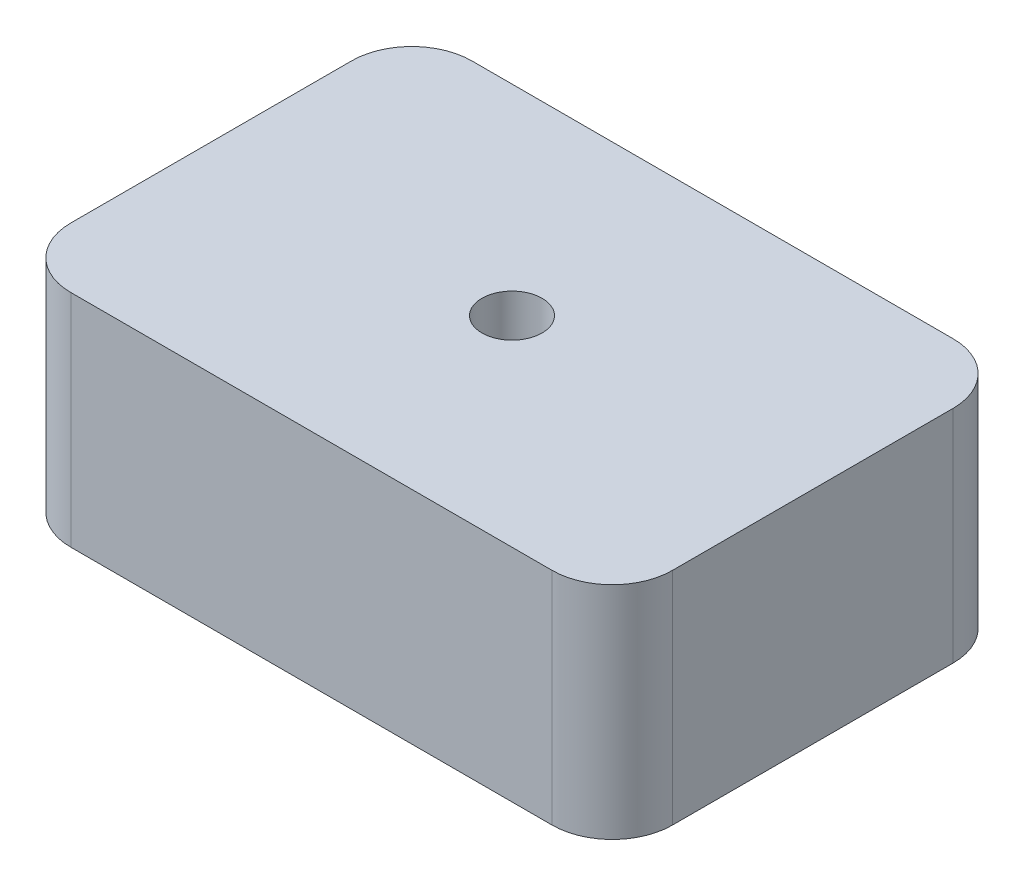
ISO-10303-21;
HEADER;
FILE_DESCRIPTION(('STEP AP214'),'2;1');
FILE_NAME('part.step','',(''),(''),'','','');
FILE_SCHEMA(('AUTOMOTIVE_DESIGN { 1 0 10303 214 1 1 1 1 }'));
ENDSEC;
DATA;
#1=APPLICATION_CONTEXT('core data for automotive mechanical design processes');
#2=APPLICATION_PROTOCOL_DEFINITION('international standard','automotive_design',2000,#1);
#3=PRODUCT_CONTEXT('',#1,'mechanical');
#4=PRODUCT('Part','Part','',(#3));
#5=PRODUCT_RELATED_PRODUCT_CATEGORY('part','',(#4));
#6=PRODUCT_DEFINITION_FORMATION('','',#4);
#7=PRODUCT_DEFINITION_CONTEXT('part definition',#1,'design');
#8=PRODUCT_DEFINITION('design','',#6,#7);
#9=PRODUCT_DEFINITION_SHAPE('','',#8);
#10=(LENGTH_UNIT() NAMED_UNIT(*) SI_UNIT(.MILLI.,.METRE.));
#11=(NAMED_UNIT(*) PLANE_ANGLE_UNIT() SI_UNIT($,.RADIAN.));
#12=(NAMED_UNIT(*) SI_UNIT($,.STERADIAN.) SOLID_ANGLE_UNIT());
#13=UNCERTAINTY_MEASURE_WITH_UNIT(LENGTH_MEASURE(1.E-05),#10,'distance_accuracy_value','');
#14=(GEOMETRIC_REPRESENTATION_CONTEXT(3) GLOBAL_UNCERTAINTY_ASSIGNED_CONTEXT((#13)) GLOBAL_UNIT_ASSIGNED_CONTEXT((#10,
#11,#12)) REPRESENTATION_CONTEXT('',''));
#15=CARTESIAN_POINT('',(0.,0.,0.));
#16=DIRECTION('',(0.,0.,1.));
#17=DIRECTION('',(1.,0.,0.));
#18=AXIS2_PLACEMENT_3D('',#15,#16,#17);
#19=CARTESIAN_POINT('',(0.,55.,0.));
#20=DIRECTION('',(0.,-1.,0.));
#21=DIRECTION('',(0.,0.,-1.));
#22=AXIS2_PLACEMENT_3D('',#19,#20,#21);
#23=PLANE('',#22);
#24=DIRECTION('',(0.,0.,-1.));
#25=VECTOR('',#24,1.);
#26=CARTESIAN_POINT('',(75.,55.,50.));
#27=LINE('',#26,#25);
#28=CARTESIAN_POINT('',(75.,55.,35.));
#29=VERTEX_POINT('',#28);
#30=CARTESIAN_POINT('',(75.,55.,-35.));
#31=VERTEX_POINT('',#30);
#32=EDGE_CURVE('E149',#29,#31,#27,.T.);
#33=ORIENTED_EDGE('',*,*,#32,.T.);
#34=CARTESIAN_POINT('',(60.,55.,-35.));
#35=DIRECTION('',(0.,-1.,0.));
#36=DIRECTION('',(0.,0.,-1.));
#37=AXIS2_PLACEMENT_3D('',#34,#35,#36);
#38=CIRCLE('',#37,15.);
#39=CARTESIAN_POINT('',(60.,55.,-50.));
#40=VERTEX_POINT('',#39);
#41=EDGE_CURVE('E173',#31,#40,#38,.F.);
#42=ORIENTED_EDGE('',*,*,#41,.T.);
#43=DIRECTION('',(-1.,0.,0.));
#44=VECTOR('',#43,1.);
#45=CARTESIAN_POINT('',(-75.,55.,-50.));
#46=LINE('',#45,#44);
#47=CARTESIAN_POINT('',(-60.,55.,-50.));
#48=VERTEX_POINT('',#47);
#49=EDGE_CURVE('E126',#40,#48,#46,.T.);
#50=ORIENTED_EDGE('',*,*,#49,.T.);
#51=CARTESIAN_POINT('',(-60.,55.,-35.));
#52=DIRECTION('',(0.,-1.,0.));
#53=DIRECTION('',(0.,0.,-1.));
#54=AXIS2_PLACEMENT_3D('',#51,#52,#53);
#55=CIRCLE('',#54,15.);
#56=CARTESIAN_POINT('',(-75.,55.,-35.));
#57=VERTEX_POINT('',#56);
#58=EDGE_CURVE('E170',#48,#57,#55,.F.);
#59=ORIENTED_EDGE('',*,*,#58,.T.);
#60=DIRECTION('',(0.,0.,1.));
#61=VECTOR('',#60,1.);
#62=CARTESIAN_POINT('',(-75.,55.,50.));
#63=LINE('',#62,#61);
#64=CARTESIAN_POINT('',(-75.,55.,35.));
#65=VERTEX_POINT('',#64);
#66=EDGE_CURVE('E185',#57,#65,#63,.T.);
#67=ORIENTED_EDGE('',*,*,#66,.T.);
#68=CARTESIAN_POINT('',(-60.,55.,35.));
#69=DIRECTION('',(0.,-1.,0.));
#70=DIRECTION('',(0.,0.,-1.));
#71=AXIS2_PLACEMENT_3D('',#68,#69,#70);
#72=CIRCLE('',#71,15.);
#73=CARTESIAN_POINT('',(-60.,55.,50.));
#74=VERTEX_POINT('',#73);
#75=EDGE_CURVE('E60',#65,#74,#72,.F.);
#76=ORIENTED_EDGE('',*,*,#75,.T.);
#77=DIRECTION('',(1.,0.,0.));
#78=VECTOR('',#77,1.);
#79=CARTESIAN_POINT('',(-75.,55.,50.));
#80=LINE('',#79,#78);
#81=CARTESIAN_POINT('',(60.,55.,50.));
#82=VERTEX_POINT('',#81);
#83=EDGE_CURVE('E151',#74,#82,#80,.T.);
#84=ORIENTED_EDGE('',*,*,#83,.T.);
#85=CARTESIAN_POINT('',(60.,55.,35.));
#86=DIRECTION('',(0.,-1.,0.));
#87=DIRECTION('',(0.,0.,-1.));
#88=AXIS2_PLACEMENT_3D('',#85,#86,#87);
#89=CIRCLE('',#88,15.);
#90=EDGE_CURVE('E165',#82,#29,#89,.F.);
#91=ORIENTED_EDGE('',*,*,#90,.T.);
#92=EDGE_LOOP('',(#33,#42,#50,#59,#67,#76,#84,#91));
#93=FACE_BOUND('',#92,.T.);
#94=CARTESIAN_POINT('',(0.,55.,0.));
#95=DIRECTION('',(0.,1.,0.));
#96=DIRECTION('',(0.,0.,1.));
#97=AXIS2_PLACEMENT_3D('',#94,#95,#96);
#98=CIRCLE('',#97,7.5);
#99=CARTESIAN_POINT('',(0.,55.,7.5));
#100=VERTEX_POINT('',#99);
#101=EDGE_CURVE('E143',#100,#100,#98,.T.);
#102=ORIENTED_EDGE('',*,*,#101,.F.);
#103=EDGE_LOOP('',(#102));
#104=FACE_BOUND('',#103,.T.);
#105=ADVANCED_FACE('F38',(#93,#104),#23,.F.);
#106=CARTESIAN_POINT('',(0.,0.,0.));
#107=DIRECTION('',(0.,-1.,0.));
#108=DIRECTION('',(0.,0.,-1.));
#109=AXIS2_PLACEMENT_3D('',#106,#107,#108);
#110=PLANE('',#109);
#111=DIRECTION('',(-1.,0.,0.));
#112=VECTOR('',#111,1.);
#113=CARTESIAN_POINT('',(-75.,0.,-50.));
#114=LINE('',#113,#112);
#115=CARTESIAN_POINT('',(60.,0.,-50.));
#116=VERTEX_POINT('',#115);
#117=CARTESIAN_POINT('',(-60.,0.,-50.));
#118=VERTEX_POINT('',#117);
#119=EDGE_CURVE('E123',#116,#118,#114,.T.);
#120=ORIENTED_EDGE('',*,*,#119,.F.);
#121=CARTESIAN_POINT('',(60.,0.,-35.));
#122=DIRECTION('',(0.,-1.,0.));
#123=DIRECTION('',(0.,0.,-1.));
#124=AXIS2_PLACEMENT_3D('',#121,#122,#123);
#125=CIRCLE('',#124,15.);
#126=CARTESIAN_POINT('',(75.,0.,-35.));
#127=VERTEX_POINT('',#126);
#128=EDGE_CURVE('E105',#116,#127,#125,.T.);
#129=ORIENTED_EDGE('',*,*,#128,.T.);
#130=DIRECTION('',(0.,0.,-1.));
#131=VECTOR('',#130,1.);
#132=CARTESIAN_POINT('',(75.,0.,50.));
#133=LINE('',#132,#131);
#134=CARTESIAN_POINT('',(75.,0.,35.));
#135=VERTEX_POINT('',#134);
#136=EDGE_CURVE('E136',#135,#127,#133,.T.);
#137=ORIENTED_EDGE('',*,*,#136,.F.);
#138=CARTESIAN_POINT('',(60.,0.,35.));
#139=DIRECTION('',(0.,-1.,0.));
#140=DIRECTION('',(0.,0.,-1.));
#141=AXIS2_PLACEMENT_3D('',#138,#139,#140);
#142=CIRCLE('',#141,15.);
#143=CARTESIAN_POINT('',(60.,0.,50.));
#144=VERTEX_POINT('',#143);
#145=EDGE_CURVE('E128',#135,#144,#142,.T.);
#146=ORIENTED_EDGE('',*,*,#145,.T.);
#147=DIRECTION('',(1.,0.,0.));
#148=VECTOR('',#147,1.);
#149=CARTESIAN_POINT('',(-75.,0.,50.));
#150=LINE('',#149,#148);
#151=CARTESIAN_POINT('',(-60.,0.,50.));
#152=VERTEX_POINT('',#151);
#153=EDGE_CURVE('E141',#152,#144,#150,.T.);
#154=ORIENTED_EDGE('',*,*,#153,.F.);
#155=CARTESIAN_POINT('',(-60.,0.,35.));
#156=DIRECTION('',(0.,-1.,0.));
#157=DIRECTION('',(0.,0.,-1.));
#158=AXIS2_PLACEMENT_3D('',#155,#156,#157);
#159=CIRCLE('',#158,15.);
#160=CARTESIAN_POINT('',(-75.,0.,35.));
#161=VERTEX_POINT('',#160);
#162=EDGE_CURVE('E155',#152,#161,#159,.T.);
#163=ORIENTED_EDGE('',*,*,#162,.T.);
#164=DIRECTION('',(0.,0.,1.));
#165=VECTOR('',#164,1.);
#166=CARTESIAN_POINT('',(-75.,0.,50.));
#167=LINE('',#166,#165);
#168=CARTESIAN_POINT('',(-75.,0.,-35.));
#169=VERTEX_POINT('',#168);
#170=EDGE_CURVE('E135',#169,#161,#167,.T.);
#171=ORIENTED_EDGE('',*,*,#170,.F.);
#172=CARTESIAN_POINT('',(-60.,0.,-35.));
#173=DIRECTION('',(0.,-1.,0.));
#174=DIRECTION('',(0.,0.,-1.));
#175=AXIS2_PLACEMENT_3D('',#172,#173,#174);
#176=CIRCLE('',#175,15.);
#177=EDGE_CURVE('E117',#169,#118,#176,.T.);
#178=ORIENTED_EDGE('',*,*,#177,.T.);
#179=EDGE_LOOP('',(#120,#129,#137,#146,#154,#163,#171,#178));
#180=FACE_BOUND('',#179,.T.);
#181=CARTESIAN_POINT('',(0.,0.,0.));
#182=DIRECTION('',(0.,1.,0.));
#183=DIRECTION('',(0.,0.,1.));
#184=AXIS2_PLACEMENT_3D('',#181,#182,#183);
#185=CIRCLE('',#184,7.5);
#186=CARTESIAN_POINT('',(0.,0.,7.5));
#187=VERTEX_POINT('',#186);
#188=EDGE_CURVE('E194',#187,#187,#185,.T.);
#189=ORIENTED_EDGE('',*,*,#188,.T.);
#190=EDGE_LOOP('',(#189));
#191=FACE_BOUND('',#190,.T.);
#192=ADVANCED_FACE('F131',(#180,#191),#110,.T.);
#193=CARTESIAN_POINT('',(75.,55.,50.));
#194=DIRECTION('',(-1.,0.,0.));
#195=DIRECTION('',(0.,0.,1.));
#196=AXIS2_PLACEMENT_3D('',#193,#194,#195);
#197=PLANE('',#196);
#198=ORIENTED_EDGE('',*,*,#136,.T.);
#199=DIRECTION('',(0.,-1.,0.));
#200=VECTOR('',#199,1.);
#201=CARTESIAN_POINT('',(75.,55.,-35.));
#202=LINE('',#201,#200);
#203=EDGE_CURVE('E110',#127,#31,#202,.F.);
#204=ORIENTED_EDGE('',*,*,#203,.T.);
#205=ORIENTED_EDGE('',*,*,#32,.F.);
#206=DIRECTION('',(0.,-1.,0.));
#207=VECTOR('',#206,1.);
#208=CARTESIAN_POINT('',(75.,55.,35.));
#209=LINE('',#208,#207);
#210=EDGE_CURVE('E116',#29,#135,#209,.T.);
#211=ORIENTED_EDGE('',*,*,#210,.T.);
#212=EDGE_LOOP('',(#198,#204,#205,#211));
#213=FACE_BOUND('',#212,.T.);
#214=ADVANCED_FACE('F211',(#213),#197,.F.);
#215=CARTESIAN_POINT('',(-75.,55.,-50.));
#216=DIRECTION('',(0.,0.,1.));
#217=DIRECTION('',(1.,0.,0.));
#218=AXIS2_PLACEMENT_3D('',#215,#216,#217);
#219=PLANE('',#218);
#220=ORIENTED_EDGE('',*,*,#49,.F.);
#221=DIRECTION('',(0.,-1.,0.));
#222=VECTOR('',#221,1.);
#223=CARTESIAN_POINT('',(60.,55.,-50.));
#224=LINE('',#223,#222);
#225=EDGE_CURVE('E109',#40,#116,#224,.T.);
#226=ORIENTED_EDGE('',*,*,#225,.T.);
#227=ORIENTED_EDGE('',*,*,#119,.T.);
#228=DIRECTION('',(0.,-1.,0.));
#229=VECTOR('',#228,1.);
#230=CARTESIAN_POINT('',(-60.,55.,-50.));
#231=LINE('',#230,#229);
#232=EDGE_CURVE('E129',#118,#48,#231,.F.);
#233=ORIENTED_EDGE('',*,*,#232,.T.);
#234=EDGE_LOOP('',(#220,#226,#227,#233));
#235=FACE_BOUND('',#234,.T.);
#236=ADVANCED_FACE('F122',(#235),#219,.F.);
#237=CARTESIAN_POINT('',(-75.,55.,50.));
#238=DIRECTION('',(1.,0.,0.));
#239=DIRECTION('',(0.,0.,-1.));
#240=AXIS2_PLACEMENT_3D('',#237,#238,#239);
#241=PLANE('',#240);
#242=ORIENTED_EDGE('',*,*,#66,.F.);
#243=DIRECTION('',(0.,-1.,0.));
#244=VECTOR('',#243,1.);
#245=CARTESIAN_POINT('',(-75.,55.,-35.));
#246=LINE('',#245,#244);
#247=EDGE_CURVE('E179',#57,#169,#246,.T.);
#248=ORIENTED_EDGE('',*,*,#247,.T.);
#249=ORIENTED_EDGE('',*,*,#170,.T.);
#250=DIRECTION('',(0.,-1.,0.));
#251=VECTOR('',#250,1.);
#252=CARTESIAN_POINT('',(-75.,55.,35.));
#253=LINE('',#252,#251);
#254=EDGE_CURVE('E176',#161,#65,#253,.F.);
#255=ORIENTED_EDGE('',*,*,#254,.T.);
#256=EDGE_LOOP('',(#242,#248,#249,#255));
#257=FACE_BOUND('',#256,.T.);
#258=ADVANCED_FACE('F218',(#257),#241,.F.);
#259=CARTESIAN_POINT('',(-75.,55.,50.));
#260=DIRECTION('',(0.,0.,-1.));
#261=DIRECTION('',(-1.,0.,0.));
#262=AXIS2_PLACEMENT_3D('',#259,#260,#261);
#263=PLANE('',#262);
#264=ORIENTED_EDGE('',*,*,#83,.F.);
#265=DIRECTION('',(0.,-1.,0.));
#266=VECTOR('',#265,1.);
#267=CARTESIAN_POINT('',(-60.,55.,50.));
#268=LINE('',#267,#266);
#269=EDGE_CURVE('E11',#74,#152,#268,.T.);
#270=ORIENTED_EDGE('',*,*,#269,.T.);
#271=ORIENTED_EDGE('',*,*,#153,.T.);
#272=DIRECTION('',(0.,-1.,0.));
#273=VECTOR('',#272,1.);
#274=CARTESIAN_POINT('',(60.,55.,50.));
#275=LINE('',#274,#273);
#276=EDGE_CURVE('E47',#144,#82,#275,.F.);
#277=ORIENTED_EDGE('',*,*,#276,.T.);
#278=EDGE_LOOP('',(#264,#270,#271,#277));
#279=FACE_BOUND('',#278,.T.);
#280=ADVANCED_FACE('F215',(#279),#263,.F.);
#281=CARTESIAN_POINT('',(0.,55.,0.));
#282=DIRECTION('',(0.,-1.,0.));
#283=DIRECTION('',(0.,0.,-1.));
#284=AXIS2_PLACEMENT_3D('',#281,#282,#283);
#285=CYLINDRICAL_SURFACE('',#284,7.5);
#286=ORIENTED_EDGE('',*,*,#101,.T.);
#287=EDGE_LOOP('',(#286));
#288=FACE_BOUND('',#287,.T.);
#289=ORIENTED_EDGE('',*,*,#188,.F.);
#290=EDGE_LOOP('',(#289));
#291=FACE_BOUND('',#290,.T.);
#292=ADVANCED_FACE('F202',(#288,#291),#285,.F.);
#293=CARTESIAN_POINT('',(60.,55.,-35.));
#294=DIRECTION('',(0.,-1.,0.));
#295=DIRECTION('',(0.,0.,-1.));
#296=AXIS2_PLACEMENT_3D('',#293,#294,#295);
#297=CYLINDRICAL_SURFACE('',#296,15.);
#298=ORIENTED_EDGE('',*,*,#41,.F.);
#299=ORIENTED_EDGE('',*,*,#203,.F.);
#300=ORIENTED_EDGE('',*,*,#128,.F.);
#301=ORIENTED_EDGE('',*,*,#225,.F.);
#302=EDGE_LOOP('',(#298,#299,#300,#301));
#303=FACE_BOUND('',#302,.T.);
#304=ADVANCED_FACE('F108',(#303),#297,.T.);
#305=CARTESIAN_POINT('',(-60.,55.,-35.));
#306=DIRECTION('',(0.,-1.,0.));
#307=DIRECTION('',(0.,0.,-1.));
#308=AXIS2_PLACEMENT_3D('',#305,#306,#307);
#309=CYLINDRICAL_SURFACE('',#308,15.);
#310=ORIENTED_EDGE('',*,*,#58,.F.);
#311=ORIENTED_EDGE('',*,*,#232,.F.);
#312=ORIENTED_EDGE('',*,*,#177,.F.);
#313=ORIENTED_EDGE('',*,*,#247,.F.);
#314=EDGE_LOOP('',(#310,#311,#312,#313));
#315=FACE_BOUND('',#314,.T.);
#316=ADVANCED_FACE('F229',(#315),#309,.T.);
#317=CARTESIAN_POINT('',(-60.,55.,35.));
#318=DIRECTION('',(0.,-1.,0.));
#319=DIRECTION('',(0.,0.,-1.));
#320=AXIS2_PLACEMENT_3D('',#317,#318,#319);
#321=CYLINDRICAL_SURFACE('',#320,15.);
#322=ORIENTED_EDGE('',*,*,#75,.F.);
#323=ORIENTED_EDGE('',*,*,#254,.F.);
#324=ORIENTED_EDGE('',*,*,#162,.F.);
#325=ORIENTED_EDGE('',*,*,#269,.F.);
#326=EDGE_LOOP('',(#322,#323,#324,#325));
#327=FACE_BOUND('',#326,.T.);
#328=ADVANCED_FACE('F231',(#327),#321,.T.);
#329=CARTESIAN_POINT('',(60.,55.,35.));
#330=DIRECTION('',(0.,-1.,0.));
#331=DIRECTION('',(0.,0.,-1.));
#332=AXIS2_PLACEMENT_3D('',#329,#330,#331);
#333=CYLINDRICAL_SURFACE('',#332,15.);
#334=ORIENTED_EDGE('',*,*,#90,.F.);
#335=ORIENTED_EDGE('',*,*,#276,.F.);
#336=ORIENTED_EDGE('',*,*,#145,.F.);
#337=ORIENTED_EDGE('',*,*,#210,.F.);
#338=EDGE_LOOP('',(#334,#335,#336,#337));
#339=FACE_BOUND('',#338,.T.);
#340=ADVANCED_FACE('F40',(#339),#333,.T.);
#341=CLOSED_SHELL('',(#105,#192,#214,#236,#258,#280,#292,#304,#316,#328,#340));
#342=MANIFOLD_SOLID_BREP('B2',#341);
#343=ADVANCED_BREP_SHAPE_REPRESENTATION('',(#18,#342),#14);
#344=SHAPE_DEFINITION_REPRESENTATION(#9,#343);
ENDSEC;
END-ISO-10303-21;
